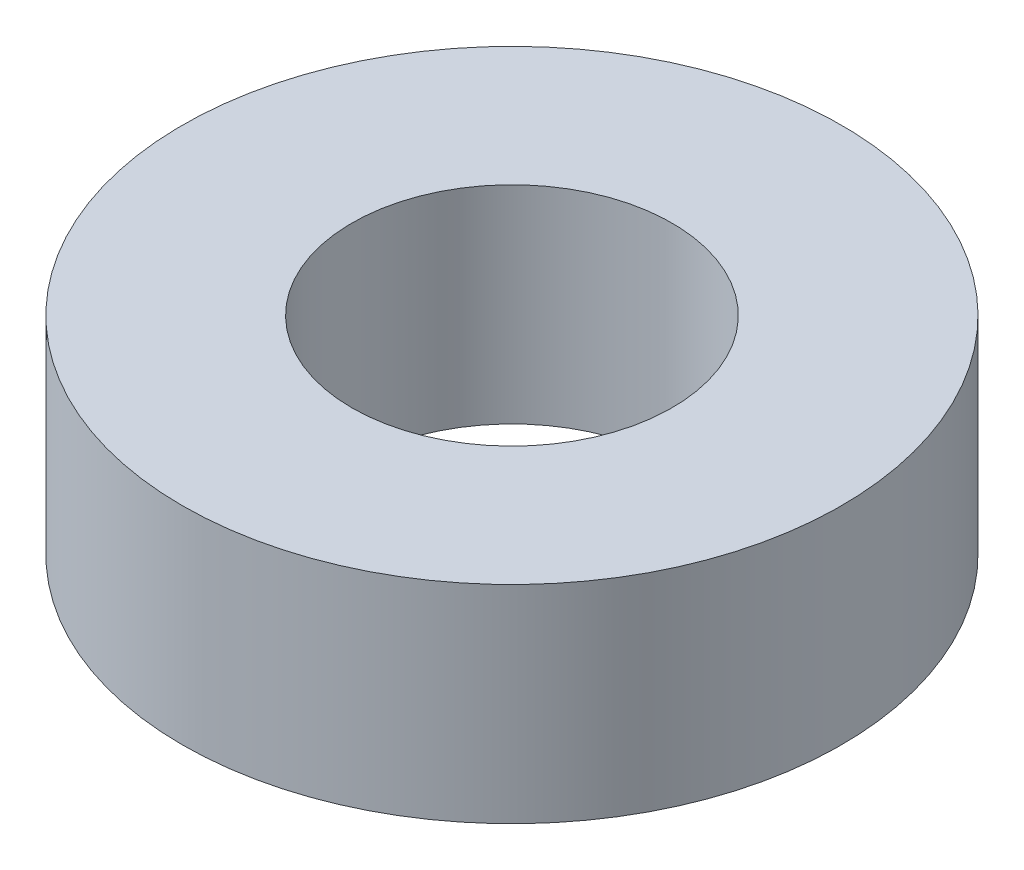
ISO-10303-21;
HEADER;
FILE_DESCRIPTION(('STEP AP214'),'2;1');
FILE_NAME('part.step','',(''),(''),'','','');
FILE_SCHEMA(('AUTOMOTIVE_DESIGN { 1 0 10303 214 1 1 1 1 }'));
ENDSEC;
DATA;
#1=APPLICATION_CONTEXT('core data for automotive mechanical design processes');
#2=APPLICATION_PROTOCOL_DEFINITION('international standard','automotive_design',2000,#1);
#3=PRODUCT_CONTEXT('',#1,'mechanical');
#4=PRODUCT('Part','Part','',(#3));
#5=PRODUCT_RELATED_PRODUCT_CATEGORY('part','',(#4));
#6=PRODUCT_DEFINITION_FORMATION('','',#4);
#7=PRODUCT_DEFINITION_CONTEXT('part definition',#1,'design');
#8=PRODUCT_DEFINITION('design','',#6,#7);
#9=PRODUCT_DEFINITION_SHAPE('','',#8);
#10=(LENGTH_UNIT() NAMED_UNIT(*) SI_UNIT(.MILLI.,.METRE.));
#11=(NAMED_UNIT(*) PLANE_ANGLE_UNIT() SI_UNIT($,.RADIAN.));
#12=(NAMED_UNIT(*) SI_UNIT($,.STERADIAN.) SOLID_ANGLE_UNIT());
#13=UNCERTAINTY_MEASURE_WITH_UNIT(LENGTH_MEASURE(1.E-05),#10,'distance_accuracy_value','');
#14=(GEOMETRIC_REPRESENTATION_CONTEXT(3) GLOBAL_UNCERTAINTY_ASSIGNED_CONTEXT((#13)) GLOBAL_UNIT_ASSIGNED_CONTEXT((#10,
#11,#12)) REPRESENTATION_CONTEXT('',''));
#15=CARTESIAN_POINT('',(0.,0.,0.));
#16=DIRECTION('',(0.,0.,1.));
#17=DIRECTION('',(1.,0.,0.));
#18=AXIS2_PLACEMENT_3D('',#15,#16,#17);
#19=CARTESIAN_POINT('',(0.,11.,0.));
#20=DIRECTION('',(0.,1.,0.));
#21=DIRECTION('',(0.,0.,1.));
#22=AXIS2_PLACEMENT_3D('',#19,#20,#21);
#23=PLANE('',#22);
#24=CARTESIAN_POINT('',(0.,11.,0.));
#25=DIRECTION('',(0.,1.,0.));
#26=DIRECTION('',(0.,0.,1.));
#27=AXIS2_PLACEMENT_3D('',#24,#25,#26);
#28=CIRCLE('',#27,17.5);
#29=CARTESIAN_POINT('',(0.,11.,17.5));
#30=VERTEX_POINT('',#29);
#31=EDGE_CURVE('E10',#30,#30,#28,.T.);
#32=ORIENTED_EDGE('',*,*,#31,.T.);
#33=EDGE_LOOP('',(#32));
#34=FACE_BOUND('',#33,.T.);
#35=CARTESIAN_POINT('',(0.,11.,0.));
#36=DIRECTION('',(0.,1.,0.));
#37=DIRECTION('',(0.,0.,1.));
#38=AXIS2_PLACEMENT_3D('',#35,#36,#37);
#39=CIRCLE('',#38,8.5);
#40=CARTESIAN_POINT('',(0.,11.,8.5));
#41=VERTEX_POINT('',#40);
#42=EDGE_CURVE('E44',#41,#41,#39,.T.);
#43=ORIENTED_EDGE('',*,*,#42,.F.);
#44=EDGE_LOOP('',(#43));
#45=FACE_BOUND('',#44,.T.);
#46=ADVANCED_FACE('F33',(#34,#45),#23,.T.);
#47=CARTESIAN_POINT('',(0.,0.,0.));
#48=DIRECTION('',(0.,1.,0.));
#49=DIRECTION('',(0.,0.,1.));
#50=AXIS2_PLACEMENT_3D('',#47,#48,#49);
#51=PLANE('',#50);
#52=CARTESIAN_POINT('',(0.,0.,0.));
#53=DIRECTION('',(0.,1.,0.));
#54=DIRECTION('',(0.,0.,1.));
#55=AXIS2_PLACEMENT_3D('',#52,#53,#54);
#56=CIRCLE('',#55,17.5);
#57=CARTESIAN_POINT('',(0.,0.,17.5));
#58=VERTEX_POINT('',#57);
#59=EDGE_CURVE('E37',#58,#58,#56,.T.);
#60=ORIENTED_EDGE('',*,*,#59,.F.);
#61=EDGE_LOOP('',(#60));
#62=FACE_BOUND('',#61,.T.);
#63=CARTESIAN_POINT('',(0.,0.,0.));
#64=DIRECTION('',(0.,1.,0.));
#65=DIRECTION('',(0.,0.,1.));
#66=AXIS2_PLACEMENT_3D('',#63,#64,#65);
#67=CIRCLE('',#66,8.5);
#68=CARTESIAN_POINT('',(0.,0.,8.5));
#69=VERTEX_POINT('',#68);
#70=EDGE_CURVE('E46',#69,#69,#67,.T.);
#71=ORIENTED_EDGE('',*,*,#70,.T.);
#72=EDGE_LOOP('',(#71));
#73=FACE_BOUND('',#72,.T.);
#74=ADVANCED_FACE('F56',(#62,#73),#51,.F.);
#75=CARTESIAN_POINT('',(0.,11.,0.));
#76=DIRECTION('',(0.,-1.,0.));
#77=DIRECTION('',(0.,0.,-1.));
#78=AXIS2_PLACEMENT_3D('',#75,#76,#77);
#79=CYLINDRICAL_SURFACE('',#78,17.5);
#80=ORIENTED_EDGE('',*,*,#31,.F.);
#81=EDGE_LOOP('',(#80));
#82=FACE_BOUND('',#81,.T.);
#83=ORIENTED_EDGE('',*,*,#59,.T.);
#84=EDGE_LOOP('',(#83));
#85=FACE_BOUND('',#84,.T.);
#86=ADVANCED_FACE('F35',(#82,#85),#79,.T.);
#87=CARTESIAN_POINT('',(0.,11.,0.));
#88=DIRECTION('',(0.,-1.,0.));
#89=DIRECTION('',(0.,0.,-1.));
#90=AXIS2_PLACEMENT_3D('',#87,#88,#89);
#91=CYLINDRICAL_SURFACE('',#90,8.5);
#92=ORIENTED_EDGE('',*,*,#42,.T.);
#93=EDGE_LOOP('',(#92));
#94=FACE_BOUND('',#93,.T.);
#95=ORIENTED_EDGE('',*,*,#70,.F.);
#96=EDGE_LOOP('',(#95));
#97=FACE_BOUND('',#96,.T.);
#98=ADVANCED_FACE('F52',(#94,#97),#91,.F.);
#99=CLOSED_SHELL('',(#46,#74,#86,#98));
#100=MANIFOLD_SOLID_BREP('B2',#99);
#101=ADVANCED_BREP_SHAPE_REPRESENTATION('',(#18,#100),#14);
#102=SHAPE_DEFINITION_REPRESENTATION(#9,#101);
ENDSEC;
END-ISO-10303-21;
